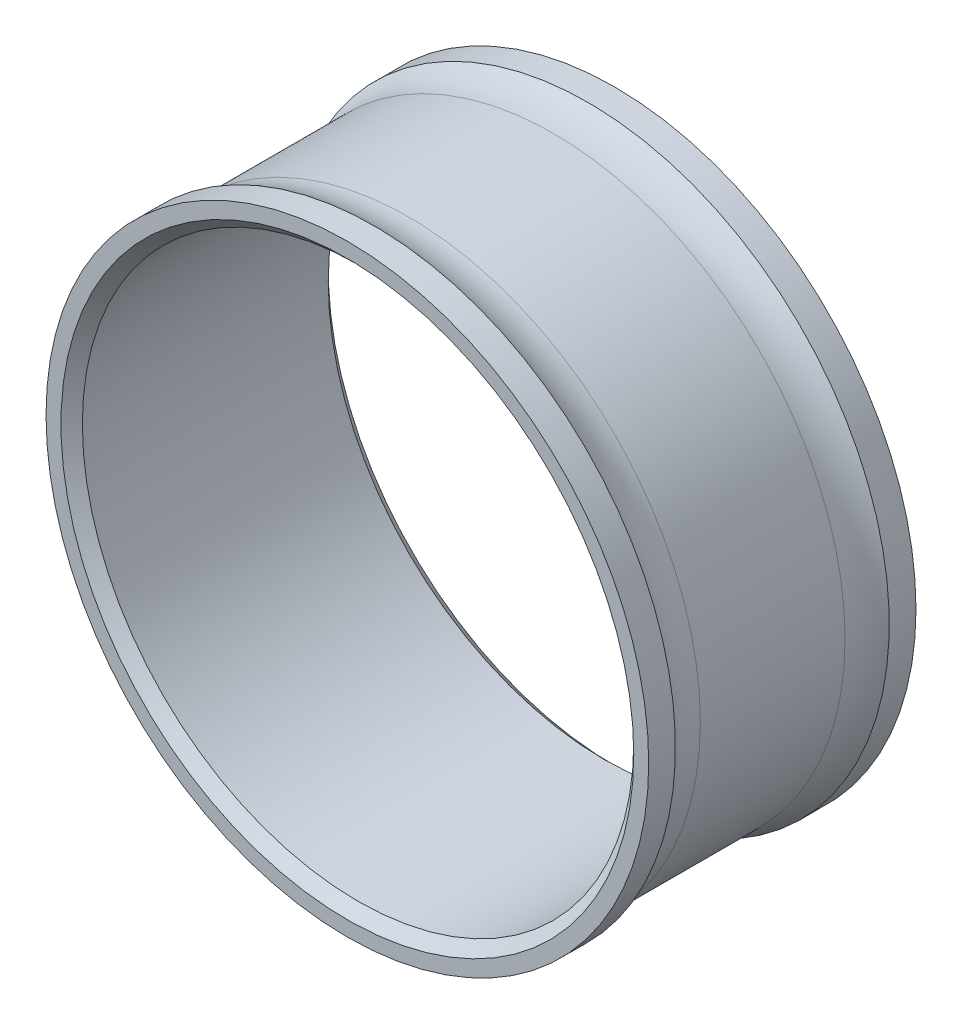
ISO-10303-21;
HEADER;
FILE_DESCRIPTION(('STEP AP214'),'2;1');
FILE_NAME('part.step','',(''),(''),'','','');
FILE_SCHEMA(('AUTOMOTIVE_DESIGN { 1 0 10303 214 1 1 1 1 }'));
ENDSEC;
DATA;
#1=APPLICATION_CONTEXT('core data for automotive mechanical design processes');
#2=APPLICATION_PROTOCOL_DEFINITION('international standard','automotive_design',2000,#1);
#3=PRODUCT_CONTEXT('',#1,'mechanical');
#4=PRODUCT('Part','Part','',(#3));
#5=PRODUCT_RELATED_PRODUCT_CATEGORY('part','',(#4));
#6=PRODUCT_DEFINITION_FORMATION('','',#4);
#7=PRODUCT_DEFINITION_CONTEXT('part definition',#1,'design');
#8=PRODUCT_DEFINITION('design','',#6,#7);
#9=PRODUCT_DEFINITION_SHAPE('','',#8);
#10=(LENGTH_UNIT() NAMED_UNIT(*) SI_UNIT(.MILLI.,.METRE.));
#11=(NAMED_UNIT(*) PLANE_ANGLE_UNIT() SI_UNIT($,.RADIAN.));
#12=(NAMED_UNIT(*) SI_UNIT($,.STERADIAN.) SOLID_ANGLE_UNIT());
#13=UNCERTAINTY_MEASURE_WITH_UNIT(LENGTH_MEASURE(1.E-05),#10,'distance_accuracy_value','');
#14=(GEOMETRIC_REPRESENTATION_CONTEXT(3) GLOBAL_UNCERTAINTY_ASSIGNED_CONTEXT((#13)) GLOBAL_UNIT_ASSIGNED_CONTEXT((#10,
#11,#12)) REPRESENTATION_CONTEXT('',''));
#15=CARTESIAN_POINT('',(0.,0.,0.));
#16=DIRECTION('',(0.,0.,1.));
#17=DIRECTION('',(1.,0.,0.));
#18=AXIS2_PLACEMENT_3D('',#15,#16,#17);
#19=CARTESIAN_POINT('',(0.,0.,15.875));
#20=DIRECTION('',(0.,0.,-1.));
#21=DIRECTION('',(-1.,0.,0.));
#22=AXIS2_PLACEMENT_3D('',#19,#20,#21);
#23=CYLINDRICAL_SURFACE('',#22,35.8013);
#24=CARTESIAN_POINT('',(0.,0.,-15.875));
#25=DIRECTION('',(0.,0.,1.));
#26=DIRECTION('',(1.,0.,0.));
#27=AXIS2_PLACEMENT_3D('',#24,#25,#26);
#28=CIRCLE('',#27,35.8013);
#29=CARTESIAN_POINT('',(35.8013,0.,-15.875));
#30=VERTEX_POINT('',#29);
#31=EDGE_CURVE('E53',#30,#30,#28,.T.);
#32=ORIENTED_EDGE('',*,*,#31,.T.);
#33=EDGE_LOOP('',(#32));
#34=FACE_BOUND('',#33,.T.);
#35=CARTESIAN_POINT('',(0.,0.,-12.7));
#36=DIRECTION('',(0.,0.,-1.));
#37=DIRECTION('',(-1.,0.,0.));
#38=AXIS2_PLACEMENT_3D('',#35,#36,#37);
#39=CIRCLE('',#38,35.8013);
#40=CARTESIAN_POINT('',(-35.8013,0.,-12.7));
#41=VERTEX_POINT('',#40);
#42=EDGE_CURVE('E67',#41,#41,#39,.T.);
#43=ORIENTED_EDGE('',*,*,#42,.T.);
#44=EDGE_LOOP('',(#43));
#45=FACE_BOUND('',#44,.T.);
#46=ADVANCED_FACE('F32',(#34,#45),#23,.T.);
#47=CARTESIAN_POINT('',(0.,0.,15.875));
#48=DIRECTION('',(0.,0.,1.));
#49=DIRECTION('',(1.,0.,0.));
#50=AXIS2_PLACEMENT_3D('',#47,#48,#49);
#51=CIRCLE('',#50,35.8013);
#52=CARTESIAN_POINT('',(35.8013,0.,15.875));
#53=VERTEX_POINT('',#52);
#54=EDGE_CURVE('E52',#53,#53,#51,.T.);
#55=ORIENTED_EDGE('',*,*,#54,.F.);
#56=EDGE_LOOP('',(#55));
#57=FACE_BOUND('',#56,.T.);
#58=CARTESIAN_POINT('',(0.,0.,12.7));
#59=DIRECTION('',(0.,0.,-1.));
#60=DIRECTION('',(-1.,0.,0.));
#61=AXIS2_PLACEMENT_3D('',#58,#59,#60);
#62=CIRCLE('',#61,35.8013);
#63=CARTESIAN_POINT('',(-35.8013,0.,12.7));
#64=VERTEX_POINT('',#63);
#65=EDGE_CURVE('E64',#64,#64,#62,.T.);
#66=ORIENTED_EDGE('',*,*,#65,.F.);
#67=EDGE_LOOP('',(#66));
#68=FACE_BOUND('',#67,.T.);
#69=ADVANCED_FACE('F88',(#57,#68),#23,.T.);
#70=CARTESIAN_POINT('',(0.,0.,15.875));
#71=DIRECTION('',(0.,0.,1.));
#72=DIRECTION('',(1.,0.,0.));
#73=AXIS2_PLACEMENT_3D('',#70,#71,#72);
#74=PLANE('',#73);
#75=CARTESIAN_POINT('',(0.,0.,15.875));
#76=DIRECTION('',(0.,0.,1.));
#77=DIRECTION('',(1.,0.,0.));
#78=AXIS2_PLACEMENT_3D('',#75,#76,#77);
#79=CIRCLE('',#78,34.024);
#80=CARTESIAN_POINT('',(34.024,0.,15.875));
#81=VERTEX_POINT('',#80);
#82=EDGE_CURVE('E10',#81,#81,#79,.F.);
#83=ORIENTED_EDGE('',*,*,#82,.T.);
#84=EDGE_LOOP('',(#83));
#85=FACE_BOUND('',#84,.T.);
#86=ORIENTED_EDGE('',*,*,#54,.T.);
#87=EDGE_LOOP('',(#86));
#88=FACE_BOUND('',#87,.T.);
#89=ADVANCED_FACE('F94',(#85,#88),#74,.T.);
#90=CARTESIAN_POINT('',(0.,0.,-15.875));
#91=DIRECTION('',(0.,0.,1.));
#92=DIRECTION('',(1.,0.,0.));
#93=AXIS2_PLACEMENT_3D('',#90,#91,#92);
#94=PLANE('',#93);
#95=CARTESIAN_POINT('',(0.,0.,-15.875));
#96=DIRECTION('',(0.,0.,1.));
#97=DIRECTION('',(1.,0.,0.));
#98=AXIS2_PLACEMENT_3D('',#95,#96,#97);
#99=CIRCLE('',#98,34.024);
#100=CARTESIAN_POINT('',(34.024,0.,-15.875));
#101=VERTEX_POINT('',#100);
#102=EDGE_CURVE('E47',#101,#101,#99,.T.);
#103=ORIENTED_EDGE('',*,*,#102,.T.);
#104=EDGE_LOOP('',(#103));
#105=FACE_BOUND('',#104,.T.);
#106=ORIENTED_EDGE('',*,*,#31,.F.);
#107=EDGE_LOOP('',(#106));
#108=FACE_BOUND('',#107,.T.);
#109=ADVANCED_FACE('F97',(#105,#108),#94,.F.);
#110=CARTESIAN_POINT('',(0.,0.,15.875));
#111=DIRECTION('',(0.,0.,-1.));
#112=DIRECTION('',(-1.,0.,0.));
#113=AXIS2_PLACEMENT_3D('',#110,#111,#112);
#114=CYLINDRICAL_SURFACE('',#113,32.754);
#115=CARTESIAN_POINT('',(0.,0.,-14.605));
#116=DIRECTION('',(0.,0.,1.));
#117=DIRECTION('',(1.,0.,0.));
#118=AXIS2_PLACEMENT_3D('',#115,#116,#117);
#119=CIRCLE('',#118,32.754);
#120=CARTESIAN_POINT('',(32.754,0.,-14.605));
#121=VERTEX_POINT('',#120);
#122=EDGE_CURVE('E39',#121,#121,#119,.F.);
#123=ORIENTED_EDGE('',*,*,#122,.T.);
#124=EDGE_LOOP('',(#123));
#125=FACE_BOUND('',#124,.T.);
#126=CARTESIAN_POINT('',(0.,0.,14.605));
#127=DIRECTION('',(0.,0.,1.));
#128=DIRECTION('',(1.,0.,0.));
#129=AXIS2_PLACEMENT_3D('',#126,#127,#128);
#130=CIRCLE('',#129,32.754);
#131=CARTESIAN_POINT('',(32.754,0.,14.605));
#132=VERTEX_POINT('',#131);
#133=EDGE_CURVE('E43',#132,#132,#130,.T.);
#134=ORIENTED_EDGE('',*,*,#133,.T.);
#135=EDGE_LOOP('',(#134));
#136=FACE_BOUND('',#135,.T.);
#137=ADVANCED_FACE('F100',(#125,#136),#114,.F.);
#138=CARTESIAN_POINT('',(0.,0.,-15.875));
#139=DIRECTION('',(0.,0.,-1.));
#140=DIRECTION('',(-1.,0.,0.));
#141=AXIS2_PLACEMENT_3D('',#138,#139,#140);
#142=CONICAL_SURFACE('',#141,34.024,0.785398163397446);
#143=ORIENTED_EDGE('',*,*,#122,.F.);
#144=EDGE_LOOP('',(#143));
#145=FACE_BOUND('',#144,.T.);
#146=ORIENTED_EDGE('',*,*,#102,.F.);
#147=EDGE_LOOP('',(#146));
#148=FACE_BOUND('',#147,.T.);
#149=ADVANCED_FACE('F84',(#145,#148),#142,.F.);
#150=CARTESIAN_POINT('',(0.,0.,14.605));
#151=DIRECTION('',(0.,0.,1.));
#152=DIRECTION('',(1.,0.,0.));
#153=AXIS2_PLACEMENT_3D('',#150,#151,#152);
#154=CONICAL_SURFACE('',#153,32.754,0.785398163397451);
#155=ORIENTED_EDGE('',*,*,#82,.F.);
#156=EDGE_LOOP('',(#155));
#157=FACE_BOUND('',#156,.T.);
#158=ORIENTED_EDGE('',*,*,#133,.F.);
#159=EDGE_LOOP('',(#158));
#160=FACE_BOUND('',#159,.T.);
#161=ADVANCED_FACE('F34',(#157,#160),#154,.F.);
#162=CARTESIAN_POINT('',(0.,0.,-8.59766368882315));
#163=DIRECTION('',(0.,0.,-1.));
#164=DIRECTION('',(-1.,0.,0.));
#165=AXIS2_PLACEMENT_3D('',#162,#163,#164);
#166=TOROIDAL_SURFACE('',#165,42.5965,7.9375);
#167=CARTESIAN_POINT('',(0.,0.,-8.59766368882315));
#168=DIRECTION('',(0.,0.,-1.));
#169=DIRECTION('',(-1.,0.,0.));
#170=AXIS2_PLACEMENT_3D('',#167,#168,#169);
#171=CIRCLE('',#170,34.659);
#172=CARTESIAN_POINT('',(-34.659,0.,-8.59766368882315));
#173=VERTEX_POINT('',#172);
#174=EDGE_CURVE('E56',#173,#173,#171,.T.);
#175=ORIENTED_EDGE('',*,*,#174,.T.);
#176=EDGE_LOOP('',(#175));
#177=FACE_BOUND('',#176,.T.);
#178=ORIENTED_EDGE('',*,*,#42,.F.);
#179=EDGE_LOOP('',(#178));
#180=FACE_BOUND('',#179,.T.);
#181=ADVANCED_FACE('F72',(#177,#180),#166,.F.);
#182=CARTESIAN_POINT('',(0.,0.,-15.875));
#183=DIRECTION('',(0.,0.,-1.));
#184=DIRECTION('',(-1.,0.,0.));
#185=AXIS2_PLACEMENT_3D('',#182,#183,#184);
#186=CYLINDRICAL_SURFACE('',#185,34.659);
#187=CARTESIAN_POINT('',(0.,0.,8.59766368882315));
#188=DIRECTION('',(0.,0.,-1.));
#189=DIRECTION('',(-1.,0.,0.));
#190=AXIS2_PLACEMENT_3D('',#187,#188,#189);
#191=CIRCLE('',#190,34.659);
#192=CARTESIAN_POINT('',(-34.659,0.,8.59766368882315));
#193=VERTEX_POINT('',#192);
#194=EDGE_CURVE('E61',#193,#193,#191,.T.);
#195=ORIENTED_EDGE('',*,*,#194,.T.);
#196=EDGE_LOOP('',(#195));
#197=FACE_BOUND('',#196,.T.);
#198=ORIENTED_EDGE('',*,*,#174,.F.);
#199=EDGE_LOOP('',(#198));
#200=FACE_BOUND('',#199,.T.);
#201=ADVANCED_FACE('F74',(#197,#200),#186,.T.);
#202=CARTESIAN_POINT('',(0.,0.,8.59766368882315));
#203=DIRECTION('',(0.,0.,-1.));
#204=DIRECTION('',(-1.,0.,0.));
#205=AXIS2_PLACEMENT_3D('',#202,#203,#204);
#206=TOROIDAL_SURFACE('',#205,42.5965,7.9375);
#207=ORIENTED_EDGE('',*,*,#65,.T.);
#208=EDGE_LOOP('',(#207));
#209=FACE_BOUND('',#208,.T.);
#210=ORIENTED_EDGE('',*,*,#194,.F.);
#211=EDGE_LOOP('',(#210));
#212=FACE_BOUND('',#211,.T.);
#213=ADVANCED_FACE('F81',(#209,#212),#206,.F.);
#214=CLOSED_SHELL('',(#46,#69,#89,#109,#137,#149,#161,#181,#201,#213));
#215=MANIFOLD_SOLID_BREP('B2',#214);
#216=ADVANCED_BREP_SHAPE_REPRESENTATION('',(#18,#215),#14);
#217=SHAPE_DEFINITION_REPRESENTATION(#9,#216);
ENDSEC;
END-ISO-10303-21;
